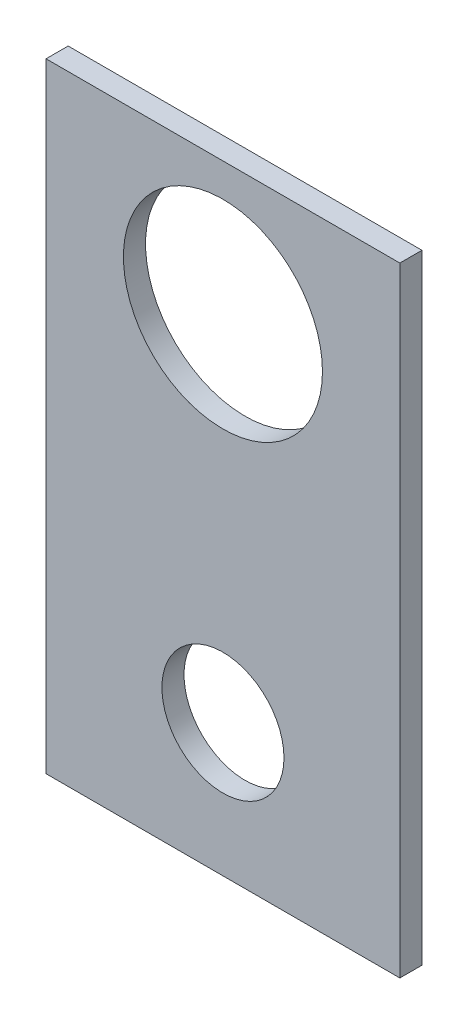
ISO-10303-21;
HEADER;
FILE_DESCRIPTION(('STEP AP214'),'2;1');
FILE_NAME('part.step','',(''),(''),'','','');
FILE_SCHEMA(('AUTOMOTIVE_DESIGN { 1 0 10303 214 1 1 1 1 }'));
ENDSEC;
DATA;
#1=APPLICATION_CONTEXT('core data for automotive mechanical design processes');
#2=APPLICATION_PROTOCOL_DEFINITION('international standard','automotive_design',2000,#1);
#3=PRODUCT_CONTEXT('',#1,'mechanical');
#4=PRODUCT('Part','Part','',(#3));
#5=PRODUCT_RELATED_PRODUCT_CATEGORY('part','',(#4));
#6=PRODUCT_DEFINITION_FORMATION('','',#4);
#7=PRODUCT_DEFINITION_CONTEXT('part definition',#1,'design');
#8=PRODUCT_DEFINITION('design','',#6,#7);
#9=PRODUCT_DEFINITION_SHAPE('','',#8);
#10=(LENGTH_UNIT() NAMED_UNIT(*) SI_UNIT(.MILLI.,.METRE.));
#11=(NAMED_UNIT(*) PLANE_ANGLE_UNIT() SI_UNIT($,.RADIAN.));
#12=(NAMED_UNIT(*) SI_UNIT($,.STERADIAN.) SOLID_ANGLE_UNIT());
#13=UNCERTAINTY_MEASURE_WITH_UNIT(LENGTH_MEASURE(1.E-05),#10,'distance_accuracy_value','');
#14=(GEOMETRIC_REPRESENTATION_CONTEXT(3) GLOBAL_UNCERTAINTY_ASSIGNED_CONTEXT((#13)) GLOBAL_UNIT_ASSIGNED_CONTEXT((#10,
#11,#12)) REPRESENTATION_CONTEXT('',''));
#15=CARTESIAN_POINT('',(0.,0.,0.));
#16=DIRECTION('',(0.,0.,1.));
#17=DIRECTION('',(1.,0.,0.));
#18=AXIS2_PLACEMENT_3D('',#15,#16,#17);
#19=CARTESIAN_POINT('',(0.,0.,3.175));
#20=DIRECTION('',(0.,0.,-1.));
#21=DIRECTION('',(-1.,0.,0.));
#22=AXIS2_PLACEMENT_3D('',#19,#20,#21);
#23=PLANE('',#22);
#24=DIRECTION('',(0.,-1.,0.));
#25=VECTOR('',#24,1.);
#26=CARTESIAN_POINT('',(0.,0.,3.175));
#27=LINE('',#26,#25);
#28=CARTESIAN_POINT('',(0.,88.9,3.175));
#29=VERTEX_POINT('',#28);
#30=CARTESIAN_POINT('',(0.,0.,3.175));
#31=VERTEX_POINT('',#30);
#32=EDGE_CURVE('E87',#29,#31,#27,.T.);
#33=ORIENTED_EDGE('',*,*,#32,.T.);
#34=DIRECTION('',(1.,0.,0.));
#35=VECTOR('',#34,1.);
#36=CARTESIAN_POINT('',(0.,0.,3.175));
#37=LINE('',#36,#35);
#38=CARTESIAN_POINT('',(50.8,0.,3.175));
#39=VERTEX_POINT('',#38);
#40=EDGE_CURVE('E82',#31,#39,#37,.T.);
#41=ORIENTED_EDGE('',*,*,#40,.T.);
#42=DIRECTION('',(0.,1.,0.));
#43=VECTOR('',#42,1.);
#44=CARTESIAN_POINT('',(50.8,0.,3.175));
#45=LINE('',#44,#43);
#46=CARTESIAN_POINT('',(50.8,88.9,3.175));
#47=VERTEX_POINT('',#46);
#48=EDGE_CURVE('E85',#39,#47,#45,.T.);
#49=ORIENTED_EDGE('',*,*,#48,.T.);
#50=DIRECTION('',(-1.,0.,0.));
#51=VECTOR('',#50,1.);
#52=CARTESIAN_POINT('',(0.,88.9,3.175));
#53=LINE('',#52,#51);
#54=EDGE_CURVE('E52',#47,#29,#53,.T.);
#55=ORIENTED_EDGE('',*,*,#54,.T.);
#56=EDGE_LOOP('',(#33,#41,#49,#55));
#57=FACE_BOUND('',#56,.T.);
#58=CARTESIAN_POINT('',(25.4,69.85,3.175));
#59=DIRECTION('',(0.,0.,1.));
#60=DIRECTION('',(1.,0.,0.));
#61=AXIS2_PLACEMENT_3D('',#58,#59,#60);
#62=CIRCLE('',#61,14.2875);
#63=CARTESIAN_POINT('',(39.6875,69.85,3.175));
#64=VERTEX_POINT('',#63);
#65=EDGE_CURVE('E102',#64,#64,#62,.T.);
#66=ORIENTED_EDGE('',*,*,#65,.F.);
#67=EDGE_LOOP('',(#66));
#68=FACE_BOUND('',#67,.T.);
#69=CARTESIAN_POINT('',(25.4,19.05,3.175));
#70=DIRECTION('',(0.,0.,1.));
#71=DIRECTION('',(1.,0.,0.));
#72=AXIS2_PLACEMENT_3D('',#69,#70,#71);
#73=CIRCLE('',#72,8.76299999999998);
#74=CARTESIAN_POINT('',(34.163,19.05,3.175));
#75=VERTEX_POINT('',#74);
#76=EDGE_CURVE('E117',#75,#75,#73,.T.);
#77=ORIENTED_EDGE('',*,*,#76,.F.);
#78=EDGE_LOOP('',(#77));
#79=FACE_BOUND('',#78,.T.);
#80=ADVANCED_FACE('F35',(#57,#68,#79),#23,.F.);
#81=CARTESIAN_POINT('',(0.,0.,0.));
#82=DIRECTION('',(0.,0.,-1.));
#83=DIRECTION('',(-1.,0.,0.));
#84=AXIS2_PLACEMENT_3D('',#81,#82,#83);
#85=PLANE('',#84);
#86=CARTESIAN_POINT('',(25.4,69.85,0.));
#87=DIRECTION('',(0.,0.,1.));
#88=DIRECTION('',(1.,0.,0.));
#89=AXIS2_PLACEMENT_3D('',#86,#87,#88);
#90=CIRCLE('',#89,14.2875);
#91=CARTESIAN_POINT('',(39.6875,69.85,0.));
#92=VERTEX_POINT('',#91);
#93=EDGE_CURVE('E114',#92,#92,#90,.T.);
#94=ORIENTED_EDGE('',*,*,#93,.T.);
#95=EDGE_LOOP('',(#94));
#96=FACE_BOUND('',#95,.T.);
#97=DIRECTION('',(0.,-1.,0.));
#98=VECTOR('',#97,1.);
#99=CARTESIAN_POINT('',(0.,0.,0.));
#100=LINE('',#99,#98);
#101=CARTESIAN_POINT('',(0.,88.9,0.));
#102=VERTEX_POINT('',#101);
#103=CARTESIAN_POINT('',(0.,0.,0.));
#104=VERTEX_POINT('',#103);
#105=EDGE_CURVE('E99',#102,#104,#100,.T.);
#106=ORIENTED_EDGE('',*,*,#105,.F.);
#107=DIRECTION('',(-1.,0.,0.));
#108=VECTOR('',#107,1.);
#109=CARTESIAN_POINT('',(0.,88.9,0.));
#110=LINE('',#109,#108);
#111=CARTESIAN_POINT('',(50.8,88.9,0.));
#112=VERTEX_POINT('',#111);
#113=EDGE_CURVE('E75',#112,#102,#110,.T.);
#114=ORIENTED_EDGE('',*,*,#113,.F.);
#115=DIRECTION('',(0.,1.,0.));
#116=VECTOR('',#115,1.);
#117=CARTESIAN_POINT('',(50.8,0.,0.));
#118=LINE('',#117,#116);
#119=CARTESIAN_POINT('',(50.8,0.,0.));
#120=VERTEX_POINT('',#119);
#121=EDGE_CURVE('E69',#120,#112,#118,.T.);
#122=ORIENTED_EDGE('',*,*,#121,.F.);
#123=DIRECTION('',(1.,0.,0.));
#124=VECTOR('',#123,1.);
#125=CARTESIAN_POINT('',(0.,0.,0.));
#126=LINE('',#125,#124);
#127=EDGE_CURVE('E91',#104,#120,#126,.T.);
#128=ORIENTED_EDGE('',*,*,#127,.F.);
#129=EDGE_LOOP('',(#106,#114,#122,#128));
#130=FACE_BOUND('',#129,.T.);
#131=CARTESIAN_POINT('',(25.4,19.05,0.));
#132=DIRECTION('',(0.,0.,1.));
#133=DIRECTION('',(1.,0.,0.));
#134=AXIS2_PLACEMENT_3D('',#131,#132,#133);
#135=CIRCLE('',#134,8.76299999999998);
#136=CARTESIAN_POINT('',(34.163,19.05,0.));
#137=VERTEX_POINT('',#136);
#138=EDGE_CURVE('E120',#137,#137,#135,.T.);
#139=ORIENTED_EDGE('',*,*,#138,.T.);
#140=EDGE_LOOP('',(#139));
#141=FACE_BOUND('',#140,.T.);
#142=ADVANCED_FACE('F110',(#96,#130,#141),#85,.T.);
#143=CARTESIAN_POINT('',(0.,0.,3.175));
#144=DIRECTION('',(1.,0.,0.));
#145=DIRECTION('',(0.,0.,-1.));
#146=AXIS2_PLACEMENT_3D('',#143,#144,#145);
#147=PLANE('',#146);
#148=ORIENTED_EDGE('',*,*,#105,.T.);
#149=DIRECTION('',(0.,0.,-1.));
#150=VECTOR('',#149,1.);
#151=CARTESIAN_POINT('',(0.,0.,3.175));
#152=LINE('',#151,#150);
#153=EDGE_CURVE('E11',#31,#104,#152,.T.);
#154=ORIENTED_EDGE('',*,*,#153,.F.);
#155=ORIENTED_EDGE('',*,*,#32,.F.);
#156=DIRECTION('',(0.,0.,-1.));
#157=VECTOR('',#156,1.);
#158=CARTESIAN_POINT('',(0.,88.9,3.175));
#159=LINE('',#158,#157);
#160=EDGE_CURVE('E95',#29,#102,#159,.T.);
#161=ORIENTED_EDGE('',*,*,#160,.T.);
#162=EDGE_LOOP('',(#148,#154,#155,#161));
#163=FACE_BOUND('',#162,.T.);
#164=ADVANCED_FACE('F37',(#163),#147,.F.);
#165=CARTESIAN_POINT('',(0.,0.,3.175));
#166=DIRECTION('',(0.,1.,0.));
#167=DIRECTION('',(0.,0.,1.));
#168=AXIS2_PLACEMENT_3D('',#165,#166,#167);
#169=PLANE('',#168);
#170=ORIENTED_EDGE('',*,*,#127,.T.);
#171=DIRECTION('',(0.,0.,-1.));
#172=VECTOR('',#171,1.);
#173=CARTESIAN_POINT('',(50.8,0.,3.175));
#174=LINE('',#173,#172);
#175=EDGE_CURVE('E44',#39,#120,#174,.T.);
#176=ORIENTED_EDGE('',*,*,#175,.F.);
#177=ORIENTED_EDGE('',*,*,#40,.F.);
#178=ORIENTED_EDGE('',*,*,#153,.T.);
#179=EDGE_LOOP('',(#170,#176,#177,#178));
#180=FACE_BOUND('',#179,.T.);
#181=ADVANCED_FACE('F90',(#180),#169,.F.);
#182=CARTESIAN_POINT('',(50.8,0.,3.175));
#183=DIRECTION('',(-1.,0.,0.));
#184=DIRECTION('',(0.,0.,1.));
#185=AXIS2_PLACEMENT_3D('',#182,#183,#184);
#186=PLANE('',#185);
#187=ORIENTED_EDGE('',*,*,#121,.T.);
#188=DIRECTION('',(0.,0.,-1.));
#189=VECTOR('',#188,1.);
#190=CARTESIAN_POINT('',(50.8,88.9,3.175));
#191=LINE('',#190,#189);
#192=EDGE_CURVE('E92',#47,#112,#191,.T.);
#193=ORIENTED_EDGE('',*,*,#192,.F.);
#194=ORIENTED_EDGE('',*,*,#48,.F.);
#195=ORIENTED_EDGE('',*,*,#175,.T.);
#196=EDGE_LOOP('',(#187,#193,#194,#195));
#197=FACE_BOUND('',#196,.T.);
#198=ADVANCED_FACE('F93',(#197),#186,.F.);
#199=CARTESIAN_POINT('',(0.,88.9,3.175));
#200=DIRECTION('',(0.,-1.,0.));
#201=DIRECTION('',(0.,0.,-1.));
#202=AXIS2_PLACEMENT_3D('',#199,#200,#201);
#203=PLANE('',#202);
#204=ORIENTED_EDGE('',*,*,#113,.T.);
#205=ORIENTED_EDGE('',*,*,#160,.F.);
#206=ORIENTED_EDGE('',*,*,#54,.F.);
#207=ORIENTED_EDGE('',*,*,#192,.T.);
#208=EDGE_LOOP('',(#204,#205,#206,#207));
#209=FACE_BOUND('',#208,.T.);
#210=ADVANCED_FACE('F107',(#209),#203,.F.);
#211=CARTESIAN_POINT('',(25.4,69.85,3.175));
#212=DIRECTION('',(0.,0.,-1.));
#213=DIRECTION('',(-1.,0.,0.));
#214=AXIS2_PLACEMENT_3D('',#211,#212,#213);
#215=CYLINDRICAL_SURFACE('',#214,14.2875);
#216=ORIENTED_EDGE('',*,*,#65,.T.);
#217=EDGE_LOOP('',(#216));
#218=FACE_BOUND('',#217,.T.);
#219=ORIENTED_EDGE('',*,*,#93,.F.);
#220=EDGE_LOOP('',(#219));
#221=FACE_BOUND('',#220,.T.);
#222=ADVANCED_FACE('F137',(#218,#221),#215,.F.);
#223=CARTESIAN_POINT('',(25.4,19.05,3.175));
#224=DIRECTION('',(0.,0.,-1.));
#225=DIRECTION('',(-1.,0.,0.));
#226=AXIS2_PLACEMENT_3D('',#223,#224,#225);
#227=CYLINDRICAL_SURFACE('',#226,8.76299999999998);
#228=ORIENTED_EDGE('',*,*,#76,.T.);
#229=EDGE_LOOP('',(#228));
#230=FACE_BOUND('',#229,.T.);
#231=ORIENTED_EDGE('',*,*,#138,.F.);
#232=EDGE_LOOP('',(#231));
#233=FACE_BOUND('',#232,.T.);
#234=ADVANCED_FACE('F126',(#230,#233),#227,.F.);
#235=CLOSED_SHELL('',(#80,#142,#164,#181,#198,#210,#222,#234));
#236=MANIFOLD_SOLID_BREP('B2',#235);
#237=ADVANCED_BREP_SHAPE_REPRESENTATION('',(#18,#236),#14);
#238=SHAPE_DEFINITION_REPRESENTATION(#9,#237);
ENDSEC;
END-ISO-10303-21;
